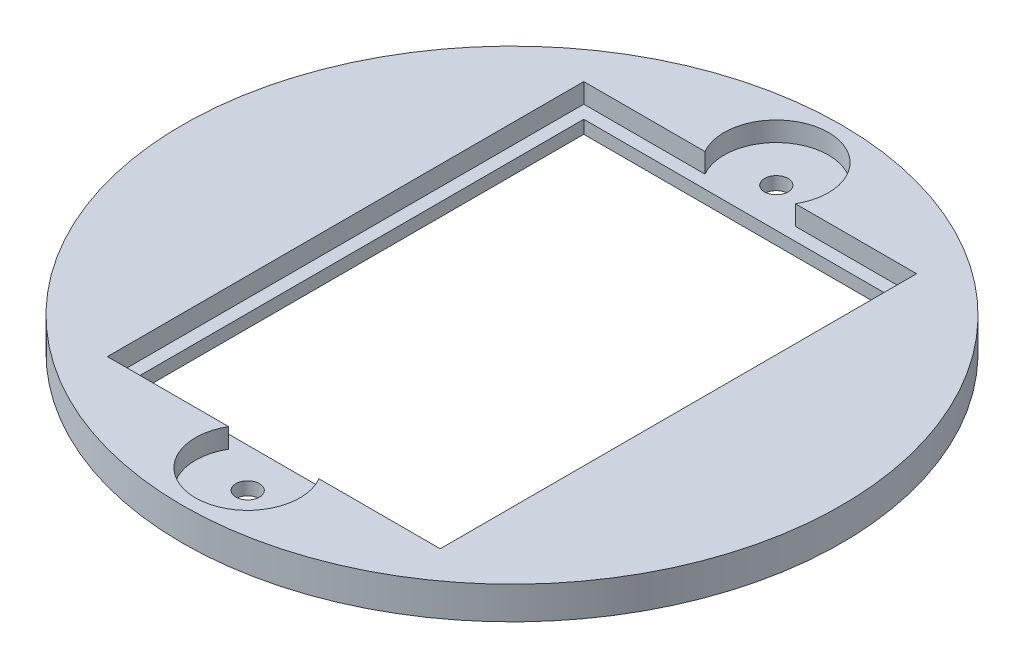
ISO-10303-21;
HEADER;
FILE_DESCRIPTION(('STEP AP214'),'2;1');
FILE_NAME('part.step','',(''),(''),'','','');
FILE_SCHEMA(('AUTOMOTIVE_DESIGN { 1 0 10303 214 1 1 1 1 }'));
ENDSEC;
DATA;
#1=APPLICATION_CONTEXT('core data for automotive mechanical design processes');
#2=APPLICATION_PROTOCOL_DEFINITION('international standard','automotive_design',2000,#1);
#3=PRODUCT_CONTEXT('',#1,'mechanical');
#4=PRODUCT('Part','Part','',(#3));
#5=PRODUCT_RELATED_PRODUCT_CATEGORY('part','',(#4));
#6=PRODUCT_DEFINITION_FORMATION('','',#4);
#7=PRODUCT_DEFINITION_CONTEXT('part definition',#1,'design');
#8=PRODUCT_DEFINITION('design','',#6,#7);
#9=PRODUCT_DEFINITION_SHAPE('','',#8);
#10=(LENGTH_UNIT() NAMED_UNIT(*) SI_UNIT(.MILLI.,.METRE.));
#11=(NAMED_UNIT(*) PLANE_ANGLE_UNIT() SI_UNIT($,.RADIAN.));
#12=(NAMED_UNIT(*) SI_UNIT($,.STERADIAN.) SOLID_ANGLE_UNIT());
#13=UNCERTAINTY_MEASURE_WITH_UNIT(LENGTH_MEASURE(1.E-05),#10,'distance_accuracy_value','');
#14=(GEOMETRIC_REPRESENTATION_CONTEXT(3) GLOBAL_UNCERTAINTY_ASSIGNED_CONTEXT((#13)) GLOBAL_UNIT_ASSIGNED_CONTEXT((#10,
#11,#12)) REPRESENTATION_CONTEXT('',''));
#15=CARTESIAN_POINT('',(0.,0.,0.));
#16=DIRECTION('',(0.,0.,1.));
#17=DIRECTION('',(1.,0.,0.));
#18=AXIS2_PLACEMENT_3D('',#15,#16,#17);
#19=CARTESIAN_POINT('',(-12.75,1.,18.25));
#20=DIRECTION('',(0.,0.,1.));
#21=DIRECTION('',(1.,0.,0.));
#22=AXIS2_PLACEMENT_3D('',#19,#20,#21);
#23=PLANE('',#22);
#24=DIRECTION('',(1.,0.,0.));
#25=VECTOR('',#24,1.);
#26=CARTESIAN_POINT('',(-12.75,1.,18.25));
#27=LINE('',#26,#25);
#28=CARTESIAN_POINT('',(3.46410161513775,1.,18.25));
#29=VERTEX_POINT('',#28);
#30=CARTESIAN_POINT('',(12.75,1.,18.25));
#31=VERTEX_POINT('',#30);
#32=EDGE_CURVE('E141',#29,#31,#27,.T.);
#33=ORIENTED_EDGE('',*,*,#32,.F.);
#34=DIRECTION('',(0.,1.,0.));
#35=VECTOR('',#34,1.);
#36=CARTESIAN_POINT('',(3.46410161513775,1.,18.25));
#37=LINE('',#36,#35);
#38=CARTESIAN_POINT('',(3.46410161513775,2.5,18.25));
#39=VERTEX_POINT('',#38);
#40=EDGE_CURVE('E124',#29,#39,#37,.T.);
#41=ORIENTED_EDGE('',*,*,#40,.T.);
#42=DIRECTION('',(1.,0.,0.));
#43=VECTOR('',#42,1.);
#44=CARTESIAN_POINT('',(-12.75,2.5,18.25));
#45=LINE('',#44,#43);
#46=CARTESIAN_POINT('',(12.75,2.5,18.25));
#47=VERTEX_POINT('',#46);
#48=EDGE_CURVE('E159',#39,#47,#45,.T.);
#49=ORIENTED_EDGE('',*,*,#48,.T.);
#50=DIRECTION('',(0.,1.,0.));
#51=VECTOR('',#50,1.);
#52=CARTESIAN_POINT('',(12.75,1.,18.25));
#53=LINE('',#52,#51);
#54=EDGE_CURVE('E162',#31,#47,#53,.T.);
#55=ORIENTED_EDGE('',*,*,#54,.F.);
#56=EDGE_LOOP('',(#33,#41,#49,#55));
#57=FACE_BOUND('',#56,.T.);
#58=ADVANCED_FACE('F33',(#57),#23,.F.);
#59=CARTESIAN_POINT('',(-12.75,1.,-18.25));
#60=DIRECTION('',(0.,0.,-1.));
#61=DIRECTION('',(-1.,0.,0.));
#62=AXIS2_PLACEMENT_3D('',#59,#60,#61);
#63=PLANE('',#62);
#64=DIRECTION('',(-1.,0.,0.));
#65=VECTOR('',#64,1.);
#66=CARTESIAN_POINT('',(-12.75,1.,-18.25));
#67=LINE('',#66,#65);
#68=CARTESIAN_POINT('',(-3.46410161513775,1.,-18.25));
#69=VERTEX_POINT('',#68);
#70=CARTESIAN_POINT('',(-12.75,1.,-18.25));
#71=VERTEX_POINT('',#70);
#72=EDGE_CURVE('E230',#69,#71,#67,.T.);
#73=ORIENTED_EDGE('',*,*,#72,.F.);
#74=DIRECTION('',(0.,1.,0.));
#75=VECTOR('',#74,1.);
#76=CARTESIAN_POINT('',(-3.46410161513775,1.,-18.25));
#77=LINE('',#76,#75);
#78=CARTESIAN_POINT('',(-3.46410161513775,2.5,-18.25));
#79=VERTEX_POINT('',#78);
#80=EDGE_CURVE('E195',#69,#79,#77,.T.);
#81=ORIENTED_EDGE('',*,*,#80,.T.);
#82=DIRECTION('',(-1.,0.,0.));
#83=VECTOR('',#82,1.);
#84=CARTESIAN_POINT('',(-12.75,2.5,-18.25));
#85=LINE('',#84,#83);
#86=CARTESIAN_POINT('',(-12.75,2.5,-18.25));
#87=VERTEX_POINT('',#86);
#88=EDGE_CURVE('E151',#79,#87,#85,.T.);
#89=ORIENTED_EDGE('',*,*,#88,.T.);
#90=DIRECTION('',(0.,1.,0.));
#91=VECTOR('',#90,1.);
#92=CARTESIAN_POINT('',(-12.75,1.,-18.25));
#93=LINE('',#92,#91);
#94=EDGE_CURVE('E144',#71,#87,#93,.T.);
#95=ORIENTED_EDGE('',*,*,#94,.F.);
#96=EDGE_LOOP('',(#73,#81,#89,#95));
#97=FACE_BOUND('',#96,.T.);
#98=ADVANCED_FACE('F233',(#97),#63,.F.);
#99=CARTESIAN_POINT('',(0.,2.5,0.));
#100=DIRECTION('',(0.,-1.,0.));
#101=DIRECTION('',(0.,0.,-1.));
#102=AXIS2_PLACEMENT_3D('',#99,#100,#101);
#103=CYLINDRICAL_SURFACE('',#102,25.25);
#104=CARTESIAN_POINT('',(0.,2.5,0.));
#105=DIRECTION('',(0.,1.,0.));
#106=DIRECTION('',(0.,0.,1.));
#107=AXIS2_PLACEMENT_3D('',#104,#105,#106);
#108=CIRCLE('',#107,25.25);
#109=CARTESIAN_POINT('',(0.,2.5,25.25));
#110=VERTEX_POINT('',#109);
#111=EDGE_CURVE('E11',#110,#110,#108,.T.);
#112=ORIENTED_EDGE('',*,*,#111,.F.);
#113=EDGE_LOOP('',(#112));
#114=FACE_BOUND('',#113,.T.);
#115=CARTESIAN_POINT('',(0.,0.,0.));
#116=DIRECTION('',(0.,1.,0.));
#117=DIRECTION('',(0.,0.,1.));
#118=AXIS2_PLACEMENT_3D('',#115,#116,#117);
#119=CIRCLE('',#118,25.25);
#120=CARTESIAN_POINT('',(0.,0.,25.25));
#121=VERTEX_POINT('',#120);
#122=EDGE_CURVE('E37',#121,#121,#119,.T.);
#123=ORIENTED_EDGE('',*,*,#122,.T.);
#124=EDGE_LOOP('',(#123));
#125=FACE_BOUND('',#124,.T.);
#126=ADVANCED_FACE('F35',(#114,#125),#103,.T.);
#127=CARTESIAN_POINT('',(0.,2.5,0.));
#128=DIRECTION('',(0.,1.,0.));
#129=DIRECTION('',(0.,0.,1.));
#130=AXIS2_PLACEMENT_3D('',#127,#128,#129);
#131=PLANE('',#130);
#132=CARTESIAN_POINT('',(0.,2.5,20.25));
#133=DIRECTION('',(0.,1.,0.));
#134=DIRECTION('',(0.,0.,1.));
#135=AXIS2_PLACEMENT_3D('',#132,#133,#134);
#136=CIRCLE('',#135,4.);
#137=CARTESIAN_POINT('',(-3.46410161513775,2.5,18.25));
#138=VERTEX_POINT('',#137);
#139=EDGE_CURVE('E126',#138,#39,#136,.T.);
#140=ORIENTED_EDGE('',*,*,#139,.F.);
#141=CARTESIAN_POINT('',(-12.75,2.5,18.25));
#142=VERTEX_POINT('',#141);
#143=EDGE_CURVE('E134',#142,#138,#45,.T.);
#144=ORIENTED_EDGE('',*,*,#143,.F.);
#145=DIRECTION('',(0.,0.,1.));
#146=VECTOR('',#145,1.);
#147=CARTESIAN_POINT('',(-12.75,2.5,-18.25));
#148=LINE('',#147,#146);
#149=EDGE_CURVE('E156',#87,#142,#148,.T.);
#150=ORIENTED_EDGE('',*,*,#149,.F.);
#151=ORIENTED_EDGE('',*,*,#88,.F.);
#152=CARTESIAN_POINT('',(0.,2.5,-20.25));
#153=DIRECTION('',(0.,1.,0.));
#154=DIRECTION('',(0.,0.,1.));
#155=AXIS2_PLACEMENT_3D('',#152,#153,#154);
#156=CIRCLE('',#155,4.);
#157=CARTESIAN_POINT('',(3.46410161513775,2.5,-18.25));
#158=VERTEX_POINT('',#157);
#159=EDGE_CURVE('E189',#158,#79,#156,.T.);
#160=ORIENTED_EDGE('',*,*,#159,.F.);
#161=CARTESIAN_POINT('',(12.75,2.5,-18.25));
#162=VERTEX_POINT('',#161);
#163=EDGE_CURVE('E153',#162,#158,#85,.T.);
#164=ORIENTED_EDGE('',*,*,#163,.F.);
#165=DIRECTION('',(0.,0.,-1.));
#166=VECTOR('',#165,1.);
#167=CARTESIAN_POINT('',(12.75,2.5,-18.25));
#168=LINE('',#167,#166);
#169=EDGE_CURVE('E149',#47,#162,#168,.T.);
#170=ORIENTED_EDGE('',*,*,#169,.F.);
#171=ORIENTED_EDGE('',*,*,#48,.F.);
#172=EDGE_LOOP('',(#140,#144,#150,#151,#160,#164,#170,#171));
#173=FACE_BOUND('',#172,.T.);
#174=ORIENTED_EDGE('',*,*,#111,.T.);
#175=EDGE_LOOP('',(#174));
#176=FACE_BOUND('',#175,.T.);
#177=ADVANCED_FACE('F176',(#173,#176),#131,.T.);
#178=CARTESIAN_POINT('',(0.,0.,0.));
#179=DIRECTION('',(0.,1.,0.));
#180=DIRECTION('',(0.,0.,1.));
#181=AXIS2_PLACEMENT_3D('',#178,#179,#180);
#182=PLANE('',#181);
#183=CARTESIAN_POINT('',(0.,0.,20.25));
#184=DIRECTION('',(0.,1.,0.));
#185=DIRECTION('',(0.,0.,1.));
#186=AXIS2_PLACEMENT_3D('',#183,#184,#185);
#187=CIRCLE('',#186,0.9);
#188=CARTESIAN_POINT('',(0.,0.,21.15));
#189=VERTEX_POINT('',#188);
#190=EDGE_CURVE('E417',#189,#189,#187,.T.);
#191=ORIENTED_EDGE('',*,*,#190,.T.);
#192=EDGE_LOOP('',(#191));
#193=FACE_BOUND('',#192,.T.);
#194=CARTESIAN_POINT('',(0.,0.,-20.25));
#195=DIRECTION('',(0.,1.,0.));
#196=DIRECTION('',(0.,0.,1.));
#197=AXIS2_PLACEMENT_3D('',#194,#195,#196);
#198=CIRCLE('',#197,0.9);
#199=CARTESIAN_POINT('',(0.,0.,-19.35));
#200=VERTEX_POINT('',#199);
#201=EDGE_CURVE('E181',#200,#200,#198,.T.);
#202=ORIENTED_EDGE('',*,*,#201,.T.);
#203=EDGE_LOOP('',(#202));
#204=FACE_BOUND('',#203,.T.);
#205=DIRECTION('',(1.,0.,0.));
#206=VECTOR('',#205,1.);
#207=CARTESIAN_POINT('',(0.,0.,17.25));
#208=LINE('',#207,#206);
#209=CARTESIAN_POINT('',(-11.75,0.,17.25));
#210=VERTEX_POINT('',#209);
#211=CARTESIAN_POINT('',(11.75,0.,17.25));
#212=VERTEX_POINT('',#211);
#213=EDGE_CURVE('E224',#210,#212,#208,.T.);
#214=ORIENTED_EDGE('',*,*,#213,.T.);
#215=DIRECTION('',(0.,0.,-1.));
#216=VECTOR('',#215,1.);
#217=CARTESIAN_POINT('',(11.75,0.,0.));
#218=LINE('',#217,#216);
#219=CARTESIAN_POINT('',(11.75,0.,-17.25));
#220=VERTEX_POINT('',#219);
#221=EDGE_CURVE('E152',#212,#220,#218,.T.);
#222=ORIENTED_EDGE('',*,*,#221,.T.);
#223=DIRECTION('',(-1.,0.,0.));
#224=VECTOR('',#223,1.);
#225=CARTESIAN_POINT('',(0.,0.,-17.25));
#226=LINE('',#225,#224);
#227=CARTESIAN_POINT('',(-11.75,0.,-17.25));
#228=VERTEX_POINT('',#227);
#229=EDGE_CURVE('E211',#220,#228,#226,.T.);
#230=ORIENTED_EDGE('',*,*,#229,.T.);
#231=DIRECTION('',(0.,0.,1.));
#232=VECTOR('',#231,1.);
#233=CARTESIAN_POINT('',(-11.75,0.,0.));
#234=LINE('',#233,#232);
#235=EDGE_CURVE('E221',#228,#210,#234,.T.);
#236=ORIENTED_EDGE('',*,*,#235,.T.);
#237=EDGE_LOOP('',(#214,#222,#230,#236));
#238=FACE_BOUND('',#237,.T.);
#239=ORIENTED_EDGE('',*,*,#122,.F.);
#240=EDGE_LOOP('',(#239));
#241=FACE_BOUND('',#240,.T.);
#242=ADVANCED_FACE('F257',(#193,#204,#238,#241),#182,.F.);
#243=CARTESIAN_POINT('',(12.75,1.,-18.25));
#244=DIRECTION('',(1.,0.,0.));
#245=DIRECTION('',(0.,0.,-1.));
#246=AXIS2_PLACEMENT_3D('',#243,#244,#245);
#247=PLANE('',#246);
#248=ORIENTED_EDGE('',*,*,#169,.T.);
#249=DIRECTION('',(0.,1.,0.));
#250=VECTOR('',#249,1.);
#251=CARTESIAN_POINT('',(12.75,1.,-18.25));
#252=LINE('',#251,#250);
#253=CARTESIAN_POINT('',(12.75,1.,-18.25));
#254=VERTEX_POINT('',#253);
#255=EDGE_CURVE('E140',#254,#162,#252,.T.);
#256=ORIENTED_EDGE('',*,*,#255,.F.);
#257=DIRECTION('',(0.,0.,-1.));
#258=VECTOR('',#257,1.);
#259=CARTESIAN_POINT('',(12.75,1.,-18.25));
#260=LINE('',#259,#258);
#261=EDGE_CURVE('E161',#31,#254,#260,.T.);
#262=ORIENTED_EDGE('',*,*,#261,.F.);
#263=ORIENTED_EDGE('',*,*,#54,.T.);
#264=EDGE_LOOP('',(#248,#256,#262,#263));
#265=FACE_BOUND('',#264,.T.);
#266=ADVANCED_FACE('F241',(#265),#247,.F.);
#267=ORIENTED_EDGE('',*,*,#143,.T.);
#268=DIRECTION('',(0.,1.,0.));
#269=VECTOR('',#268,1.);
#270=CARTESIAN_POINT('',(-3.46410161513775,1.,18.25));
#271=LINE('',#270,#269);
#272=CARTESIAN_POINT('',(-3.46410161513775,1.,18.25));
#273=VERTEX_POINT('',#272);
#274=EDGE_CURVE('E121',#138,#273,#271,.F.);
#275=ORIENTED_EDGE('',*,*,#274,.T.);
#276=CARTESIAN_POINT('',(-12.75,1.,18.25));
#277=VERTEX_POINT('',#276);
#278=EDGE_CURVE('E132',#277,#273,#27,.T.);
#279=ORIENTED_EDGE('',*,*,#278,.F.);
#280=DIRECTION('',(0.,1.,0.));
#281=VECTOR('',#280,1.);
#282=CARTESIAN_POINT('',(-12.75,1.,18.25));
#283=LINE('',#282,#281);
#284=EDGE_CURVE('E165',#277,#142,#283,.T.);
#285=ORIENTED_EDGE('',*,*,#284,.T.);
#286=EDGE_LOOP('',(#267,#275,#279,#285));
#287=FACE_BOUND('',#286,.T.);
#288=ADVANCED_FACE('F131',(#287),#23,.F.);
#289=CARTESIAN_POINT('',(-12.75,1.,-18.25));
#290=DIRECTION('',(-1.,0.,0.));
#291=DIRECTION('',(0.,0.,1.));
#292=AXIS2_PLACEMENT_3D('',#289,#290,#291);
#293=PLANE('',#292);
#294=ORIENTED_EDGE('',*,*,#149,.T.);
#295=ORIENTED_EDGE('',*,*,#284,.F.);
#296=DIRECTION('',(0.,0.,1.));
#297=VECTOR('',#296,1.);
#298=CARTESIAN_POINT('',(-12.75,1.,-18.25));
#299=LINE('',#298,#297);
#300=EDGE_CURVE('E139',#71,#277,#299,.T.);
#301=ORIENTED_EDGE('',*,*,#300,.F.);
#302=ORIENTED_EDGE('',*,*,#94,.T.);
#303=EDGE_LOOP('',(#294,#295,#301,#302));
#304=FACE_BOUND('',#303,.T.);
#305=ADVANCED_FACE('F171',(#304),#293,.F.);
#306=ORIENTED_EDGE('',*,*,#163,.T.);
#307=DIRECTION('',(0.,1.,0.));
#308=VECTOR('',#307,1.);
#309=CARTESIAN_POINT('',(3.46410161513775,1.,-18.25));
#310=LINE('',#309,#308);
#311=CARTESIAN_POINT('',(3.46410161513775,1.,-18.25));
#312=VERTEX_POINT('',#311);
#313=EDGE_CURVE('E191',#158,#312,#310,.F.);
#314=ORIENTED_EDGE('',*,*,#313,.T.);
#315=EDGE_CURVE('E231',#254,#312,#67,.T.);
#316=ORIENTED_EDGE('',*,*,#315,.F.);
#317=ORIENTED_EDGE('',*,*,#255,.T.);
#318=EDGE_LOOP('',(#306,#314,#316,#317));
#319=FACE_BOUND('',#318,.T.);
#320=ADVANCED_FACE('F238',(#319),#63,.F.);
#321=CARTESIAN_POINT('',(0.,1.,0.));
#322=DIRECTION('',(0.,1.,0.));
#323=DIRECTION('',(0.,0.,1.));
#324=AXIS2_PLACEMENT_3D('',#321,#322,#323);
#325=PLANE('',#324);
#326=CARTESIAN_POINT('',(0.,1.,20.25));
#327=DIRECTION('',(0.,1.,0.));
#328=DIRECTION('',(0.,0.,1.));
#329=AXIS2_PLACEMENT_3D('',#326,#327,#328);
#330=CIRCLE('',#329,0.9);
#331=CARTESIAN_POINT('',(0.,1.,21.15));
#332=VERTEX_POINT('',#331);
#333=EDGE_CURVE('E420',#332,#332,#330,.T.);
#334=ORIENTED_EDGE('',*,*,#333,.F.);
#335=EDGE_LOOP('',(#334));
#336=FACE_BOUND('',#335,.T.);
#337=CARTESIAN_POINT('',(0.,1.,-20.25));
#338=DIRECTION('',(0.,1.,0.));
#339=DIRECTION('',(0.,0.,1.));
#340=AXIS2_PLACEMENT_3D('',#337,#338,#339);
#341=CIRCLE('',#340,0.9);
#342=CARTESIAN_POINT('',(0.,1.,-19.35));
#343=VERTEX_POINT('',#342);
#344=EDGE_CURVE('E184',#343,#343,#341,.T.);
#345=ORIENTED_EDGE('',*,*,#344,.F.);
#346=EDGE_LOOP('',(#345));
#347=FACE_BOUND('',#346,.T.);
#348=DIRECTION('',(0.,0.,-1.));
#349=VECTOR('',#348,1.);
#350=CARTESIAN_POINT('',(11.75,1.,-17.25));
#351=LINE('',#350,#349);
#352=CARTESIAN_POINT('',(11.75,1.,17.25));
#353=VERTEX_POINT('',#352);
#354=CARTESIAN_POINT('',(11.75,1.,-17.25));
#355=VERTEX_POINT('',#354);
#356=EDGE_CURVE('E198',#353,#355,#351,.T.);
#357=ORIENTED_EDGE('',*,*,#356,.F.);
#358=DIRECTION('',(1.,0.,0.));
#359=VECTOR('',#358,1.);
#360=CARTESIAN_POINT('',(-11.75,1.,17.25));
#361=LINE('',#360,#359);
#362=CARTESIAN_POINT('',(-11.75,1.,17.25));
#363=VERTEX_POINT('',#362);
#364=EDGE_CURVE('E205',#363,#353,#361,.T.);
#365=ORIENTED_EDGE('',*,*,#364,.F.);
#366=DIRECTION('',(0.,0.,1.));
#367=VECTOR('',#366,1.);
#368=CARTESIAN_POINT('',(-11.75,1.,-17.25));
#369=LINE('',#368,#367);
#370=CARTESIAN_POINT('',(-11.75,1.,-17.25));
#371=VERTEX_POINT('',#370);
#372=EDGE_CURVE('E202',#371,#363,#369,.T.);
#373=ORIENTED_EDGE('',*,*,#372,.F.);
#374=DIRECTION('',(-1.,0.,0.));
#375=VECTOR('',#374,1.);
#376=CARTESIAN_POINT('',(-11.75,1.,-17.25));
#377=LINE('',#376,#375);
#378=EDGE_CURVE('E200',#355,#371,#377,.T.);
#379=ORIENTED_EDGE('',*,*,#378,.F.);
#380=EDGE_LOOP('',(#357,#365,#373,#379));
#381=FACE_BOUND('',#380,.T.);
#382=ORIENTED_EDGE('',*,*,#278,.T.);
#383=CARTESIAN_POINT('',(0.,1.,20.25));
#384=DIRECTION('',(0.,1.,0.));
#385=DIRECTION('',(0.,0.,1.));
#386=AXIS2_PLACEMENT_3D('',#383,#384,#385);
#387=CIRCLE('',#386,4.);
#388=EDGE_CURVE('E48',#273,#29,#387,.T.);
#389=ORIENTED_EDGE('',*,*,#388,.T.);
#390=ORIENTED_EDGE('',*,*,#32,.T.);
#391=ORIENTED_EDGE('',*,*,#261,.T.);
#392=ORIENTED_EDGE('',*,*,#315,.T.);
#393=CARTESIAN_POINT('',(0.,1.,-20.25));
#394=DIRECTION('',(0.,1.,0.));
#395=DIRECTION('',(0.,0.,1.));
#396=AXIS2_PLACEMENT_3D('',#393,#394,#395);
#397=CIRCLE('',#396,4.);
#398=EDGE_CURVE('E55',#312,#69,#397,.T.);
#399=ORIENTED_EDGE('',*,*,#398,.T.);
#400=ORIENTED_EDGE('',*,*,#72,.T.);
#401=ORIENTED_EDGE('',*,*,#300,.T.);
#402=EDGE_LOOP('',(#382,#389,#390,#391,#392,#399,#400,#401));
#403=FACE_BOUND('',#402,.T.);
#404=ADVANCED_FACE('F137',(#336,#347,#381,#403),#325,.T.);
#405=CARTESIAN_POINT('',(11.75,-0.2,-17.25));
#406=DIRECTION('',(1.,0.,0.));
#407=DIRECTION('',(0.,0.,-1.));
#408=AXIS2_PLACEMENT_3D('',#405,#406,#407);
#409=PLANE('',#408);
#410=DIRECTION('',(0.,1.,0.));
#411=VECTOR('',#410,1.);
#412=CARTESIAN_POINT('',(11.75,-0.2,17.25));
#413=LINE('',#412,#411);
#414=EDGE_CURVE('E208',#212,#353,#413,.T.);
#415=ORIENTED_EDGE('',*,*,#414,.T.);
#416=ORIENTED_EDGE('',*,*,#356,.T.);
#417=DIRECTION('',(0.,1.,0.));
#418=VECTOR('',#417,1.);
#419=CARTESIAN_POINT('',(11.75,-0.2,-17.25));
#420=LINE('',#419,#418);
#421=EDGE_CURVE('E207',#220,#355,#420,.T.);
#422=ORIENTED_EDGE('',*,*,#421,.F.);
#423=ORIENTED_EDGE('',*,*,#221,.F.);
#424=EDGE_LOOP('',(#415,#416,#422,#423));
#425=FACE_BOUND('',#424,.T.);
#426=ADVANCED_FACE('F315',(#425),#409,.F.);
#427=CARTESIAN_POINT('',(-11.75,-0.2,17.25));
#428=DIRECTION('',(0.,0.,1.));
#429=DIRECTION('',(1.,0.,0.));
#430=AXIS2_PLACEMENT_3D('',#427,#428,#429);
#431=PLANE('',#430);
#432=DIRECTION('',(0.,1.,0.));
#433=VECTOR('',#432,1.);
#434=CARTESIAN_POINT('',(-11.75,-0.2,17.25));
#435=LINE('',#434,#433);
#436=EDGE_CURVE('E212',#210,#363,#435,.T.);
#437=ORIENTED_EDGE('',*,*,#436,.T.);
#438=ORIENTED_EDGE('',*,*,#364,.T.);
#439=ORIENTED_EDGE('',*,*,#414,.F.);
#440=ORIENTED_EDGE('',*,*,#213,.F.);
#441=EDGE_LOOP('',(#437,#438,#439,#440));
#442=FACE_BOUND('',#441,.T.);
#443=ADVANCED_FACE('F309',(#442),#431,.F.);
#444=CARTESIAN_POINT('',(-11.75,-0.2,-17.25));
#445=DIRECTION('',(-1.,0.,0.));
#446=DIRECTION('',(0.,0.,1.));
#447=AXIS2_PLACEMENT_3D('',#444,#445,#446);
#448=PLANE('',#447);
#449=DIRECTION('',(0.,1.,0.));
#450=VECTOR('',#449,1.);
#451=CARTESIAN_POINT('',(-11.75,-0.2,-17.25));
#452=LINE('',#451,#450);
#453=EDGE_CURVE('E214',#228,#371,#452,.T.);
#454=ORIENTED_EDGE('',*,*,#453,.T.);
#455=ORIENTED_EDGE('',*,*,#372,.T.);
#456=ORIENTED_EDGE('',*,*,#436,.F.);
#457=ORIENTED_EDGE('',*,*,#235,.F.);
#458=EDGE_LOOP('',(#454,#455,#456,#457));
#459=FACE_BOUND('',#458,.T.);
#460=ADVANCED_FACE('F314',(#459),#448,.F.);
#461=CARTESIAN_POINT('',(-11.75,-0.2,-17.25));
#462=DIRECTION('',(0.,0.,-1.));
#463=DIRECTION('',(-1.,0.,0.));
#464=AXIS2_PLACEMENT_3D('',#461,#462,#463);
#465=PLANE('',#464);
#466=ORIENTED_EDGE('',*,*,#421,.T.);
#467=ORIENTED_EDGE('',*,*,#378,.T.);
#468=ORIENTED_EDGE('',*,*,#453,.F.);
#469=ORIENTED_EDGE('',*,*,#229,.F.);
#470=EDGE_LOOP('',(#466,#467,#468,#469));
#471=FACE_BOUND('',#470,.T.);
#472=ADVANCED_FACE('F325',(#471),#465,.F.);
#473=CARTESIAN_POINT('',(0.,1.,-20.25));
#474=DIRECTION('',(0.,1.,0.));
#475=DIRECTION('',(0.,0.,1.));
#476=AXIS2_PLACEMENT_3D('',#473,#474,#475);
#477=CYLINDRICAL_SURFACE('',#476,4.);
#478=ORIENTED_EDGE('',*,*,#398,.F.);
#479=ORIENTED_EDGE('',*,*,#313,.F.);
#480=ORIENTED_EDGE('',*,*,#159,.T.);
#481=ORIENTED_EDGE('',*,*,#80,.F.);
#482=EDGE_LOOP('',(#478,#479,#480,#481));
#483=FACE_BOUND('',#482,.T.);
#484=ADVANCED_FACE('F235',(#483),#477,.F.);
#485=CARTESIAN_POINT('',(0.,1.,20.25));
#486=DIRECTION('',(0.,1.,0.));
#487=DIRECTION('',(0.,0.,1.));
#488=AXIS2_PLACEMENT_3D('',#485,#486,#487);
#489=CYLINDRICAL_SURFACE('',#488,4.);
#490=ORIENTED_EDGE('',*,*,#388,.F.);
#491=ORIENTED_EDGE('',*,*,#274,.F.);
#492=ORIENTED_EDGE('',*,*,#139,.T.);
#493=ORIENTED_EDGE('',*,*,#40,.F.);
#494=EDGE_LOOP('',(#490,#491,#492,#493));
#495=FACE_BOUND('',#494,.T.);
#496=ADVANCED_FACE('F120',(#495),#489,.F.);
#497=CARTESIAN_POINT('',(0.,0.,-20.25));
#498=DIRECTION('',(0.,1.,0.));
#499=DIRECTION('',(0.,0.,1.));
#500=AXIS2_PLACEMENT_3D('',#497,#498,#499);
#501=CYLINDRICAL_SURFACE('',#500,0.9);
#502=ORIENTED_EDGE('',*,*,#201,.F.);
#503=EDGE_LOOP('',(#502));
#504=FACE_BOUND('',#503,.T.);
#505=ORIENTED_EDGE('',*,*,#344,.T.);
#506=EDGE_LOOP('',(#505));
#507=FACE_BOUND('',#506,.T.);
#508=ADVANCED_FACE('F347',(#504,#507),#501,.F.);
#509=CARTESIAN_POINT('',(0.,0.,20.25));
#510=DIRECTION('',(0.,1.,0.));
#511=DIRECTION('',(0.,0.,1.));
#512=AXIS2_PLACEMENT_3D('',#509,#510,#511);
#513=CYLINDRICAL_SURFACE('',#512,0.9);
#514=ORIENTED_EDGE('',*,*,#190,.F.);
#515=EDGE_LOOP('',(#514));
#516=FACE_BOUND('',#515,.T.);
#517=ORIENTED_EDGE('',*,*,#333,.T.);
#518=EDGE_LOOP('',(#517));
#519=FACE_BOUND('',#518,.T.);
#520=ADVANCED_FACE('F367',(#516,#519),#513,.F.);
#521=CLOSED_SHELL('',(#58,#98,#126,#177,#242,#266,#288,#305,#320,#404,#426,#443,#460,#472,#484,
#496,#508,#520));
#522=MANIFOLD_SOLID_BREP('B2',#521);
#523=ADVANCED_BREP_SHAPE_REPRESENTATION('',(#18,#522),#14);
#524=SHAPE_DEFINITION_REPRESENTATION(#9,#523);
ENDSEC;
END-ISO-10303-21;
